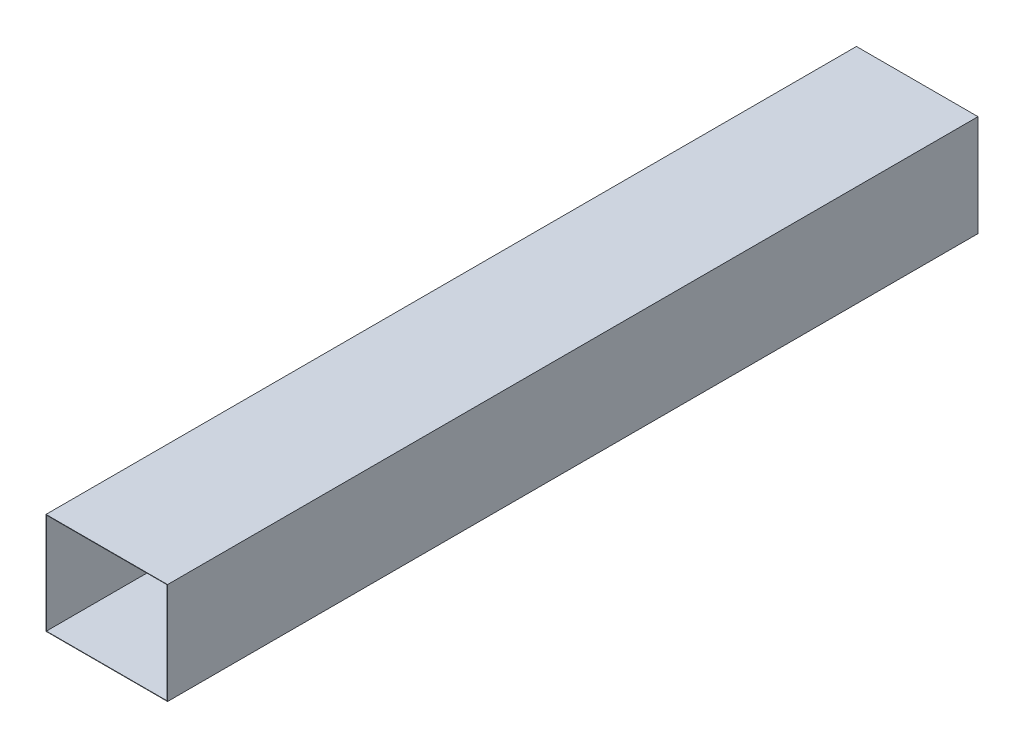
ISO-10303-21;
HEADER;
FILE_DESCRIPTION(('STEP AP214'),'2;1');
FILE_NAME('part.step','',(''),(''),'','','');
FILE_SCHEMA(('AUTOMOTIVE_DESIGN { 1 0 10303 214 1 1 1 1 }'));
ENDSEC;
DATA;
#1=APPLICATION_CONTEXT('core data for automotive mechanical design processes');
#2=APPLICATION_PROTOCOL_DEFINITION('international standard','automotive_design',2000,#1);
#3=PRODUCT_CONTEXT('',#1,'mechanical');
#4=PRODUCT('Part','Part','',(#3));
#5=PRODUCT_RELATED_PRODUCT_CATEGORY('part','',(#4));
#6=PRODUCT_DEFINITION_FORMATION('','',#4);
#7=PRODUCT_DEFINITION_CONTEXT('part definition',#1,'design');
#8=PRODUCT_DEFINITION('design','',#6,#7);
#9=PRODUCT_DEFINITION_SHAPE('','',#8);
#10=(LENGTH_UNIT() NAMED_UNIT(*) SI_UNIT(.MILLI.,.METRE.));
#11=(NAMED_UNIT(*) PLANE_ANGLE_UNIT() SI_UNIT($,.RADIAN.));
#12=(NAMED_UNIT(*) SI_UNIT($,.STERADIAN.) SOLID_ANGLE_UNIT());
#13=UNCERTAINTY_MEASURE_WITH_UNIT(LENGTH_MEASURE(1.E-05),#10,'distance_accuracy_value','');
#14=(GEOMETRIC_REPRESENTATION_CONTEXT(3) GLOBAL_UNCERTAINTY_ASSIGNED_CONTEXT((#13)) GLOBAL_UNIT_ASSIGNED_CONTEXT((#10,
#11,#12)) REPRESENTATION_CONTEXT('',''));
#15=CARTESIAN_POINT('',(0.,0.,0.));
#16=DIRECTION('',(0.,0.,1.));
#17=DIRECTION('',(1.,0.,0.));
#18=AXIS2_PLACEMENT_3D('',#15,#16,#17);
#19=CARTESIAN_POINT('',(-300.,250.,2000.));
#20=DIRECTION('',(0.,1.,0.));
#21=DIRECTION('',(0.,0.,1.));
#22=AXIS2_PLACEMENT_3D('',#19,#20,#21);
#23=PLANE('',#22);
#24=DIRECTION('',(1.,0.,0.));
#25=VECTOR('',#24,1.);
#26=CARTESIAN_POINT('',(-300.,250.,0.));
#27=LINE('',#26,#25);
#28=CARTESIAN_POINT('',(-300.,250.,0.));
#29=VERTEX_POINT('',#28);
#30=CARTESIAN_POINT('',(2.75545529808154E-13,250.,0.));
#31=VERTEX_POINT('',#30);
#32=EDGE_CURVE('E152',#29,#31,#27,.T.);
#33=ORIENTED_EDGE('',*,*,#32,.F.);
#34=DIRECTION('',(0.,0.,-1.));
#35=VECTOR('',#34,1.);
#36=CARTESIAN_POINT('',(-300.,250.,2000.));
#37=LINE('',#36,#35);
#38=CARTESIAN_POINT('',(-300.,250.,2000.));
#39=VERTEX_POINT('',#38);
#40=EDGE_CURVE('E12',#39,#29,#37,.T.);
#41=ORIENTED_EDGE('',*,*,#40,.F.);
#42=DIRECTION('',(1.,0.,0.));
#43=VECTOR('',#42,1.);
#44=CARTESIAN_POINT('',(-300.,250.,2000.));
#45=LINE('',#44,#43);
#46=CARTESIAN_POINT('',(2.75545529808154E-13,250.,2000.));
#47=VERTEX_POINT('',#46);
#48=EDGE_CURVE('E156',#39,#47,#45,.T.);
#49=ORIENTED_EDGE('',*,*,#48,.T.);
#50=DIRECTION('',(0.,0.,-1.));
#51=VECTOR('',#50,1.);
#52=CARTESIAN_POINT('',(2.75545529808154E-13,250.,2000.));
#53=LINE('',#52,#51);
#54=EDGE_CURVE('E59',#47,#31,#53,.T.);
#55=ORIENTED_EDGE('',*,*,#54,.T.);
#56=EDGE_LOOP('',(#33,#41,#49,#55));
#57=FACE_BOUND('',#56,.T.);
#58=ADVANCED_FACE('F56',(#57),#23,.T.);
#59=CARTESIAN_POINT('',(-300.,250.,2000.));
#60=DIRECTION('',(1.,0.,0.));
#61=DIRECTION('',(0.,1.,0.));
#62=AXIS2_PLACEMENT_3D('',#59,#60,#61);
#63=PLANE('',#62);
#64=DIRECTION('',(0.,-1.,0.));
#65=VECTOR('',#64,1.);
#66=CARTESIAN_POINT('',(-300.,250.,0.));
#67=LINE('',#66,#65);
#68=CARTESIAN_POINT('',(-300.,0.,0.));
#69=VERTEX_POINT('',#68);
#70=EDGE_CURVE('E160',#29,#69,#67,.T.);
#71=ORIENTED_EDGE('',*,*,#70,.T.);
#72=DIRECTION('',(0.,0.,-1.));
#73=VECTOR('',#72,1.);
#74=CARTESIAN_POINT('',(-300.,0.,2000.));
#75=LINE('',#74,#73);
#76=CARTESIAN_POINT('',(-300.,0.,2000.));
#77=VERTEX_POINT('',#76);
#78=EDGE_CURVE('E64',#77,#69,#75,.T.);
#79=ORIENTED_EDGE('',*,*,#78,.F.);
#80=DIRECTION('',(0.,-1.,0.));
#81=VECTOR('',#80,1.);
#82=CARTESIAN_POINT('',(-300.,250.,2000.));
#83=LINE('',#82,#81);
#84=EDGE_CURVE('E165',#39,#77,#83,.T.);
#85=ORIENTED_EDGE('',*,*,#84,.F.);
#86=ORIENTED_EDGE('',*,*,#40,.T.);
#87=EDGE_LOOP('',(#71,#79,#85,#86));
#88=FACE_BOUND('',#87,.T.);
#89=ADVANCED_FACE('F192',(#88),#63,.F.);
#90=CARTESIAN_POINT('',(-300.,0.,2000.));
#91=DIRECTION('',(0.,1.,0.));
#92=DIRECTION('',(0.,0.,1.));
#93=AXIS2_PLACEMENT_3D('',#90,#91,#92);
#94=PLANE('',#93);
#95=DIRECTION('',(1.,0.,0.));
#96=VECTOR('',#95,1.);
#97=CARTESIAN_POINT('',(-300.,0.,0.));
#98=LINE('',#97,#96);
#99=CARTESIAN_POINT('',(0.,0.,0.));
#100=VERTEX_POINT('',#99);
#101=EDGE_CURVE('E172',#69,#100,#98,.T.);
#102=ORIENTED_EDGE('',*,*,#101,.T.);
#103=DIRECTION('',(0.,0.,-1.));
#104=VECTOR('',#103,1.);
#105=CARTESIAN_POINT('',(0.,0.,2000.));
#106=LINE('',#105,#104);
#107=CARTESIAN_POINT('',(0.,0.,2000.));
#108=VERTEX_POINT('',#107);
#109=EDGE_CURVE('E177',#108,#100,#106,.T.);
#110=ORIENTED_EDGE('',*,*,#109,.F.);
#111=DIRECTION('',(1.,0.,0.));
#112=VECTOR('',#111,1.);
#113=CARTESIAN_POINT('',(-300.,0.,2000.));
#114=LINE('',#113,#112);
#115=EDGE_CURVE('E163',#77,#108,#114,.T.);
#116=ORIENTED_EDGE('',*,*,#115,.F.);
#117=ORIENTED_EDGE('',*,*,#78,.T.);
#118=EDGE_LOOP('',(#102,#110,#116,#117));
#119=FACE_BOUND('',#118,.T.);
#120=ADVANCED_FACE('F196',(#119),#94,.F.);
#121=CARTESIAN_POINT('',(2.75545529808154E-13,250.,2000.));
#122=DIRECTION('',(1.,0.,0.));
#123=DIRECTION('',(0.,1.,0.));
#124=AXIS2_PLACEMENT_3D('',#121,#122,#123);
#125=PLANE('',#124);
#126=DIRECTION('',(0.,-1.,0.));
#127=VECTOR('',#126,1.);
#128=CARTESIAN_POINT('',(2.75545529808154E-13,250.,0.));
#129=LINE('',#128,#127);
#130=EDGE_CURVE('E169',#31,#100,#129,.T.);
#131=ORIENTED_EDGE('',*,*,#130,.F.);
#132=ORIENTED_EDGE('',*,*,#54,.F.);
#133=DIRECTION('',(0.,-1.,0.));
#134=VECTOR('',#133,1.);
#135=CARTESIAN_POINT('',(2.75545529808154E-13,250.,2000.));
#136=LINE('',#135,#134);
#137=EDGE_CURVE('E159',#47,#108,#136,.T.);
#138=ORIENTED_EDGE('',*,*,#137,.T.);
#139=ORIENTED_EDGE('',*,*,#109,.T.);
#140=EDGE_LOOP('',(#131,#132,#138,#139));
#141=FACE_BOUND('',#140,.T.);
#142=ADVANCED_FACE('F185',(#141),#125,.T.);
#143=CARTESIAN_POINT('',(0.,0.,2000.));
#144=DIRECTION('',(0.,0.,-1.));
#145=DIRECTION('',(-1.,0.,0.));
#146=AXIS2_PLACEMENT_3D('',#143,#144,#145);
#147=PLANE('',#146);
#148=DIRECTION('',(0.,-1.,0.));
#149=VECTOR('',#148,1.);
#150=CARTESIAN_POINT('',(-299.,0.,2000.));
#151=LINE('',#150,#149);
#152=CARTESIAN_POINT('',(-299.,249.,2000.));
#153=VERTEX_POINT('',#152);
#154=CARTESIAN_POINT('',(-299.,1.,2000.));
#155=VERTEX_POINT('',#154);
#156=EDGE_CURVE('E126',#153,#155,#151,.T.);
#157=ORIENTED_EDGE('',*,*,#156,.F.);
#158=DIRECTION('',(1.,0.,0.));
#159=VECTOR('',#158,1.);
#160=CARTESIAN_POINT('',(0.,249.,2000.));
#161=LINE('',#160,#159);
#162=CARTESIAN_POINT('',(-0.999999999999726,249.,2000.));
#163=VERTEX_POINT('',#162);
#164=EDGE_CURVE('E123',#153,#163,#161,.T.);
#165=ORIENTED_EDGE('',*,*,#164,.T.);
#166=DIRECTION('',(0.,-1.,0.));
#167=VECTOR('',#166,1.);
#168=CARTESIAN_POINT('',(-1.,0.,2000.));
#169=LINE('',#168,#167);
#170=CARTESIAN_POINT('',(-0.999999999999999,1.,2000.));
#171=VERTEX_POINT('',#170);
#172=EDGE_CURVE('E129',#163,#171,#169,.T.);
#173=ORIENTED_EDGE('',*,*,#172,.T.);
#174=DIRECTION('',(1.,0.,0.));
#175=VECTOR('',#174,1.);
#176=CARTESIAN_POINT('',(0.,1.,2000.));
#177=LINE('',#176,#175);
#178=EDGE_CURVE('E133',#155,#171,#177,.T.);
#179=ORIENTED_EDGE('',*,*,#178,.F.);
#180=EDGE_LOOP('',(#157,#165,#173,#179));
#181=FACE_BOUND('',#180,.T.);
#182=ORIENTED_EDGE('',*,*,#48,.F.);
#183=ORIENTED_EDGE('',*,*,#84,.T.);
#184=ORIENTED_EDGE('',*,*,#115,.T.);
#185=ORIENTED_EDGE('',*,*,#137,.F.);
#186=EDGE_LOOP('',(#182,#183,#184,#185));
#187=FACE_BOUND('',#186,.T.);
#188=ADVANCED_FACE('F135',(#181,#187),#147,.F.);
#189=CARTESIAN_POINT('',(0.,0.,0.));
#190=DIRECTION('',(0.,0.,-1.));
#191=DIRECTION('',(-1.,0.,0.));
#192=AXIS2_PLACEMENT_3D('',#189,#190,#191);
#193=PLANE('',#192);
#194=DIRECTION('',(1.,0.,0.));
#195=VECTOR('',#194,1.);
#196=CARTESIAN_POINT('',(0.,249.,0.));
#197=LINE('',#196,#195);
#198=CARTESIAN_POINT('',(-299.,249.,0.));
#199=VERTEX_POINT('',#198);
#200=CARTESIAN_POINT('',(-0.999999999999726,249.,0.));
#201=VERTEX_POINT('',#200);
#202=EDGE_CURVE('E80',#199,#201,#197,.T.);
#203=ORIENTED_EDGE('',*,*,#202,.F.);
#204=DIRECTION('',(0.,-1.,0.));
#205=VECTOR('',#204,1.);
#206=CARTESIAN_POINT('',(-299.,0.,0.));
#207=LINE('',#206,#205);
#208=CARTESIAN_POINT('',(-299.,1.,0.));
#209=VERTEX_POINT('',#208);
#210=EDGE_CURVE('E137',#199,#209,#207,.T.);
#211=ORIENTED_EDGE('',*,*,#210,.T.);
#212=DIRECTION('',(1.,0.,0.));
#213=VECTOR('',#212,1.);
#214=CARTESIAN_POINT('',(0.,1.,0.));
#215=LINE('',#214,#213);
#216=CARTESIAN_POINT('',(-0.999999999999999,1.,0.));
#217=VERTEX_POINT('',#216);
#218=EDGE_CURVE('E140',#209,#217,#215,.T.);
#219=ORIENTED_EDGE('',*,*,#218,.T.);
#220=DIRECTION('',(0.,-1.,0.));
#221=VECTOR('',#220,1.);
#222=CARTESIAN_POINT('',(-1.,0.,0.));
#223=LINE('',#222,#221);
#224=EDGE_CURVE('E146',#201,#217,#223,.T.);
#225=ORIENTED_EDGE('',*,*,#224,.F.);
#226=EDGE_LOOP('',(#203,#211,#219,#225));
#227=FACE_BOUND('',#226,.T.);
#228=ORIENTED_EDGE('',*,*,#32,.T.);
#229=ORIENTED_EDGE('',*,*,#130,.T.);
#230=ORIENTED_EDGE('',*,*,#101,.F.);
#231=ORIENTED_EDGE('',*,*,#70,.F.);
#232=EDGE_LOOP('',(#228,#229,#230,#231));
#233=FACE_BOUND('',#232,.T.);
#234=ADVANCED_FACE('F189',(#227,#233),#193,.T.);
#235=CARTESIAN_POINT('',(0.,249.,2000.));
#236=DIRECTION('',(0.,1.,0.));
#237=DIRECTION('',(0.,0.,1.));
#238=AXIS2_PLACEMENT_3D('',#235,#236,#237);
#239=PLANE('',#238);
#240=ORIENTED_EDGE('',*,*,#202,.T.);
#241=DIRECTION('',(0.,0.,-1.));
#242=VECTOR('',#241,1.);
#243=CARTESIAN_POINT('',(-0.999999999999726,249.,2000.));
#244=LINE('',#243,#242);
#245=EDGE_CURVE('E120',#163,#201,#244,.T.);
#246=ORIENTED_EDGE('',*,*,#245,.F.);
#247=ORIENTED_EDGE('',*,*,#164,.F.);
#248=DIRECTION('',(0.,0.,-1.));
#249=VECTOR('',#248,1.);
#250=CARTESIAN_POINT('',(-299.,249.,2000.));
#251=LINE('',#250,#249);
#252=EDGE_CURVE('E150',#153,#199,#251,.T.);
#253=ORIENTED_EDGE('',*,*,#252,.T.);
#254=EDGE_LOOP('',(#240,#246,#247,#253));
#255=FACE_BOUND('',#254,.T.);
#256=ADVANCED_FACE('F121',(#255),#239,.F.);
#257=CARTESIAN_POINT('',(-299.,0.,2000.));
#258=DIRECTION('',(1.,0.,0.));
#259=DIRECTION('',(0.,1.,0.));
#260=AXIS2_PLACEMENT_3D('',#257,#258,#259);
#261=PLANE('',#260);
#262=ORIENTED_EDGE('',*,*,#210,.F.);
#263=ORIENTED_EDGE('',*,*,#252,.F.);
#264=ORIENTED_EDGE('',*,*,#156,.T.);
#265=DIRECTION('',(0.,0.,-1.));
#266=VECTOR('',#265,1.);
#267=CARTESIAN_POINT('',(-299.,1.,2000.));
#268=LINE('',#267,#266);
#269=EDGE_CURVE('E153',#155,#209,#268,.T.);
#270=ORIENTED_EDGE('',*,*,#269,.T.);
#271=EDGE_LOOP('',(#262,#263,#264,#270));
#272=FACE_BOUND('',#271,.T.);
#273=ADVANCED_FACE('F240',(#272),#261,.T.);
#274=CARTESIAN_POINT('',(0.,1.,2000.));
#275=DIRECTION('',(0.,1.,0.));
#276=DIRECTION('',(0.,0.,1.));
#277=AXIS2_PLACEMENT_3D('',#274,#275,#276);
#278=PLANE('',#277);
#279=ORIENTED_EDGE('',*,*,#218,.F.);
#280=ORIENTED_EDGE('',*,*,#269,.F.);
#281=ORIENTED_EDGE('',*,*,#178,.T.);
#282=DIRECTION('',(0.,0.,-1.));
#283=VECTOR('',#282,1.);
#284=CARTESIAN_POINT('',(-0.999999999999999,1.,2000.));
#285=LINE('',#284,#283);
#286=EDGE_CURVE('E72',#171,#217,#285,.T.);
#287=ORIENTED_EDGE('',*,*,#286,.T.);
#288=EDGE_LOOP('',(#279,#280,#281,#287));
#289=FACE_BOUND('',#288,.T.);
#290=ADVANCED_FACE('F248',(#289),#278,.T.);
#291=CARTESIAN_POINT('',(-1.,0.,2000.));
#292=DIRECTION('',(1.,0.,0.));
#293=DIRECTION('',(0.,1.,0.));
#294=AXIS2_PLACEMENT_3D('',#291,#292,#293);
#295=PLANE('',#294);
#296=ORIENTED_EDGE('',*,*,#224,.T.);
#297=ORIENTED_EDGE('',*,*,#286,.F.);
#298=ORIENTED_EDGE('',*,*,#172,.F.);
#299=ORIENTED_EDGE('',*,*,#245,.T.);
#300=EDGE_LOOP('',(#296,#297,#298,#299));
#301=FACE_BOUND('',#300,.T.);
#302=ADVANCED_FACE('F130',(#301),#295,.F.);
#303=CLOSED_SHELL('',(#58,#89,#120,#142,#188,#234,#256,#273,#290,#302));
#304=MANIFOLD_SOLID_BREP('B2',#303);
#305=ADVANCED_BREP_SHAPE_REPRESENTATION('',(#18,#304),#14);
#306=SHAPE_DEFINITION_REPRESENTATION(#9,#305);
ENDSEC;
END-ISO-10303-21;
